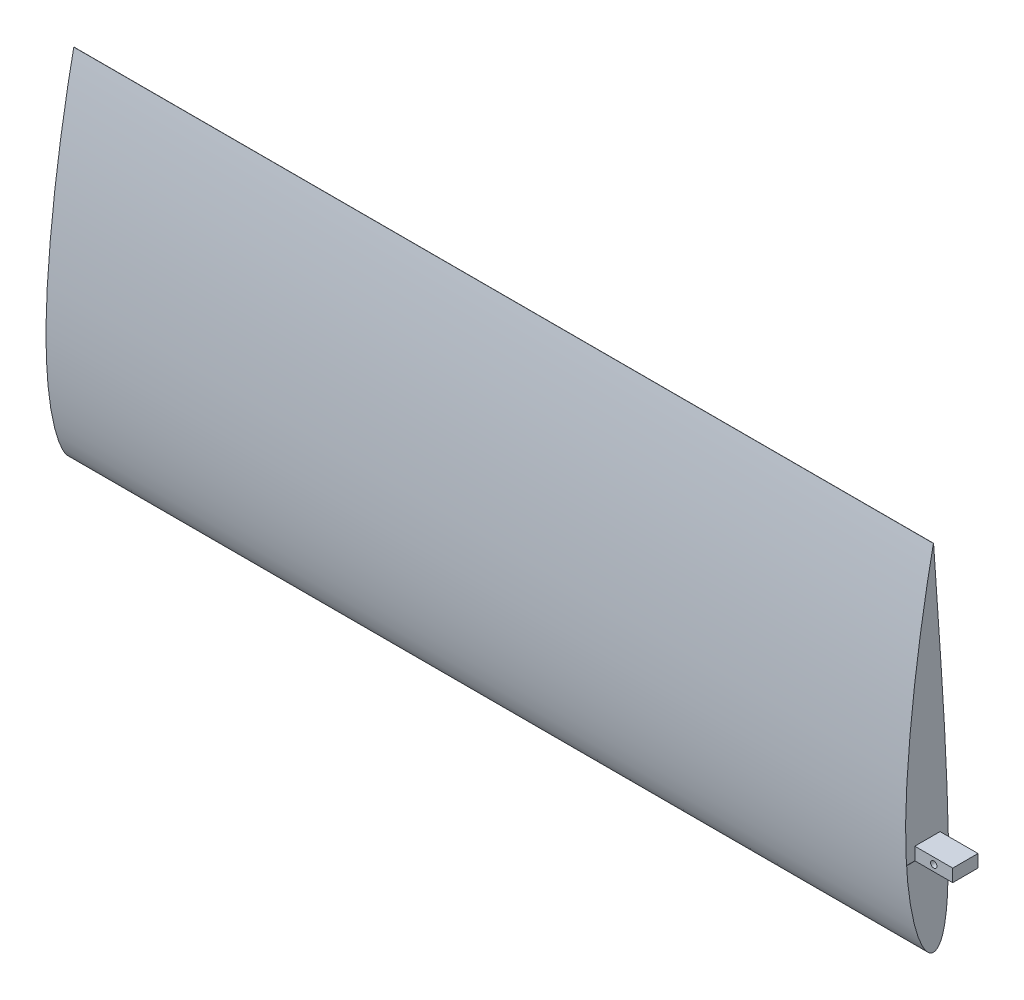
ISO-10303-21;
HEADER;
FILE_DESCRIPTION(('STEP AP214'),'2;1');
FILE_NAME('part.step','',(''),(''),'','','');
FILE_SCHEMA(('AUTOMOTIVE_DESIGN { 1 0 10303 214 1 1 1 1 }'));
ENDSEC;
DATA;
#1=APPLICATION_CONTEXT('core data for automotive mechanical design processes');
#2=APPLICATION_PROTOCOL_DEFINITION('international standard','automotive_design',2000,#1);
#3=PRODUCT_CONTEXT('',#1,'mechanical');
#4=PRODUCT('Part','Part','',(#3));
#5=PRODUCT_RELATED_PRODUCT_CATEGORY('part','',(#4));
#6=PRODUCT_DEFINITION_FORMATION('','',#4);
#7=PRODUCT_DEFINITION_CONTEXT('part definition',#1,'design');
#8=PRODUCT_DEFINITION('design','',#6,#7);
#9=PRODUCT_DEFINITION_SHAPE('','',#8);
#10=(LENGTH_UNIT() NAMED_UNIT(*) SI_UNIT(.MILLI.,.METRE.));
#11=(NAMED_UNIT(*) PLANE_ANGLE_UNIT() SI_UNIT($,.RADIAN.));
#12=(NAMED_UNIT(*) SI_UNIT($,.STERADIAN.) SOLID_ANGLE_UNIT());
#13=UNCERTAINTY_MEASURE_WITH_UNIT(LENGTH_MEASURE(1.E-05),#10,'distance_accuracy_value','');
#14=(GEOMETRIC_REPRESENTATION_CONTEXT(3) GLOBAL_UNCERTAINTY_ASSIGNED_CONTEXT((#13)) GLOBAL_UNIT_ASSIGNED_CONTEXT((#10,
#11,#12)) REPRESENTATION_CONTEXT('',''));
#15=CARTESIAN_POINT('',(0.,0.,0.));
#16=DIRECTION('',(0.,0.,1.));
#17=DIRECTION('',(1.,0.,0.));
#18=AXIS2_PLACEMENT_3D('',#15,#16,#17);
#19=CARTESIAN_POINT('',(-50.8,0.,-15.0555562963383));
#20=DIRECTION('',(-1.,0.,0.));
#21=DIRECTION('',(0.,0.,1.));
#22=AXIS2_PLACEMENT_3D('',#19,#20,#21);
#23=PLANE('',#22);
#24=DIRECTION('',(0.,1.,0.));
#25=VECTOR('',#24,1.);
#26=CARTESIAN_POINT('',(-50.8,88.6202636542648,26.5912377417045));
#27=LINE('',#26,#25);
#28=CARTESIAN_POINT('',(-50.8,88.6202636542648,26.5912377417045));
#29=VERTEX_POINT('',#28);
#30=CARTESIAN_POINT('',(-50.8,88.9250636542648,26.5912377417045));
#31=VERTEX_POINT('',#30);
#32=EDGE_CURVE('E151',#29,#31,#27,.T.);
#33=ORIENTED_EDGE('',*,*,#32,.T.);
#34=DIRECTION('',(0.,0.,1.));
#35=VECTOR('',#34,1.);
#36=CARTESIAN_POINT('',(-50.8,88.9250636542648,-14.4104133053878));
#37=LINE('',#36,#35);
#38=CARTESIAN_POINT('',(-50.8,88.9250636542648,-14.4104133053878));
#39=VERTEX_POINT('',#38);
#40=EDGE_CURVE('E57',#39,#31,#37,.T.);
#41=ORIENTED_EDGE('',*,*,#40,.F.);
#42=DIRECTION('',(0.,1.,0.));
#43=VECTOR('',#42,1.);
#44=CARTESIAN_POINT('',(-50.8,88.6202636542648,-14.4104133053878));
#45=LINE('',#44,#43);
#46=CARTESIAN_POINT('',(-50.8,88.6202636542648,-14.4104133053878));
#47=VERTEX_POINT('',#46);
#48=EDGE_CURVE('E142',#47,#39,#45,.T.);
#49=ORIENTED_EDGE('',*,*,#48,.F.);
#50=DIRECTION('',(0.,0.,1.));
#51=VECTOR('',#50,1.);
#52=CARTESIAN_POINT('',(-50.8,88.6202636542648,-14.4104133053878));
#53=LINE('',#52,#51);
#54=EDGE_CURVE('E145',#47,#29,#53,.T.);
#55=ORIENTED_EDGE('',*,*,#54,.T.);
#56=EDGE_LOOP('',(#33,#41,#49,#55));
#57=FACE_BOUND('',#56,.T.);
#58=CARTESIAN_POINT('',(-50.8000000000002,355.7016,0.0706893842356886));
#59=CARTESIAN_POINT('',(-50.8000000000002,353.82100547413,0.466477301049823));
#60=CARTESIAN_POINT('',(-50.8000000000002,350.062966049057,1.25739026761112));
#61=CARTESIAN_POINT('',(-50.8000000000002,344.419849120749,2.39126184336525));
#62=CARTESIAN_POINT('',(-50.8000000000002,338.780602166773,3.49581530783854));
#63=CARTESIAN_POINT('',(-50.8000000000002,333.145611842717,4.57193189726754));
#64=CARTESIAN_POINT('',(-50.8000000000002,327.516510889431,5.62414634625409));
#65=CARTESIAN_POINT('',(-50.8000000000002,321.894595016184,6.65413274344394));
#66=CARTESIAN_POINT('',(-50.8000000000002,314.419324108831,7.99739843751297));
#67=CARTESIAN_POINT('',(-50.8000000000002,303.257462970096,9.94552240604957));
#68=CARTESIAN_POINT('',(-50.8000000000002,290.277775074201,12.0956881119525));
#69=CARTESIAN_POINT('',(-50.8000000000002,277.369667999707,14.1082663790483));
#70=CARTESIAN_POINT('',(-50.8000000000002,266.404083363404,15.7296524484643));
#71=CARTESIAN_POINT('',(-50.8000000000002,251.980108497986,17.7452063131698));
#72=CARTESIAN_POINT('',(-50.8000000000002,237.689627435599,19.571200264272));
#73=CARTESIAN_POINT('',(-50.8000000000002,223.549431815772,21.2153057413522));
#74=CARTESIAN_POINT('',(-50.8000000000002,213.141900318429,22.3473669046667));
#75=CARTESIAN_POINT('',(-50.8000000000002,202.878012781937,23.3864814796233));
#76=CARTESIAN_POINT('',(-50.8000000000002,192.768060410721,24.3316742949856));
#77=CARTESIAN_POINT('',(-50.8000000000002,182.822187648844,25.1803267838034));
#78=CARTESIAN_POINT('',(-50.8000000000002,173.0503670548,25.9284845769859));
#79=CARTESIAN_POINT('',(-50.8000000000002,161.923020832939,26.6745625928463));
#80=CARTESIAN_POINT('',(-50.8000000000002,149.53571493793,27.3454863283283));
#81=CARTESIAN_POINT('',(-50.8000000000002,135.990974585577,27.8405517211889));
#82=CARTESIAN_POINT('',(-50.8000000000002,122.943312687998,28.0607256105301));
#83=CARTESIAN_POINT('',(-50.8000000000002,110.422427170652,28.0020460952983));
#84=CARTESIAN_POINT('',(-50.8000000000002,99.7020013483802,27.7028205773181));
#85=CARTESIAN_POINT('',(-50.8000000000002,90.6951719091241,27.2644303864963));
#86=CARTESIAN_POINT('',(-50.8000000000002,83.3050589433649,26.7782071290161));
#87=CARTESIAN_POINT('',(-50.8000000000002,76.1891846222825,26.1836028946291));
#88=CARTESIAN_POINT('',(-50.8000000000002,69.354718788338,25.486294475851));
#89=CARTESIAN_POINT('',(-50.8000000000002,62.8085372897284,24.6923981307771));
#90=CARTESIAN_POINT('',(-50.8000000000002,56.5572010238348,23.8083285855273));
#91=CARTESIAN_POINT('',(-50.8000000000002,50.6069732051584,22.8406877694768));
#92=CARTESIAN_POINT('',(-50.8000000000002,44.9638303686651,21.7962461660963));
#93=CARTESIAN_POINT('',(-50.8000000000002,39.6334152940903,20.681960011255));
#94=CARTESIAN_POINT('',(-50.8000000000002,35.3956425934143,19.6868775193447));
#95=CARTESIAN_POINT('',(-50.8000000000002,31.4207033717425,18.6688408456968));
#96=CARTESIAN_POINT('',(-50.8000000000002,28.4029957368285,17.8305039109673));
#97=CARTESIAN_POINT('',(-50.8000000000002,25.5022537885571,16.9530380094471));
#98=CARTESIAN_POINT('',(-50.8000000000002,23.4461522077182,16.2956888342787));
#99=CARTESIAN_POINT('',(-50.8000000000002,21.473655538579,15.6290160326846));
#100=CARTESIAN_POINT('',(-50.8000000000002,19.5852566859921,14.9539098171277));
#101=CARTESIAN_POINT('',(-50.8000000000002,17.7814209437135,14.2712536241703));
#102=CARTESIAN_POINT('',(-50.8000000000002,16.0625954458963,13.581895135171));
#103=CARTESIAN_POINT('',(-50.8000000000002,14.4291993290467,12.8866618837843));
#104=CARTESIAN_POINT('',(-50.8000000000002,12.8816283813181,12.186346806876));
#105=CARTESIAN_POINT('',(-50.8000000000002,11.4202611647561,11.4816860512912));
#106=CARTESIAN_POINT('',(-50.8000000000002,10.0454367904406,10.7733962918452));
#107=CARTESIAN_POINT('',(-50.8000000000002,8.75749036867076,10.0620978844044));
#108=CARTESIAN_POINT('',(-50.8000000000002,7.5567095077894,9.34839283952855));
#109=CARTESIAN_POINT('',(-50.8000000000002,6.44336997385442,8.63279200242914));
#110=CARTESIAN_POINT('',(-50.8000000000002,5.41771614805046,7.91573903030395));
#111=CARTESIAN_POINT('',(-50.8000000000002,4.47996706921155,7.19760595875919));
#112=CARTESIAN_POINT('',(-50.8000000000002,3.63032083391172,6.4786776696253));
#113=CARTESIAN_POINT('',(-50.8000000000002,2.86895727246491,5.75915597914262));
#114=CARTESIAN_POINT('',(-50.8000000000002,2.1960564902249,5.03914204783644));
#115=CARTESIAN_POINT('',(-50.8000000000002,1.61179873197572,4.31865755392047));
#116=CARTESIAN_POINT('',(-50.8000000000002,1.11641082020464,3.59763490600262));
#117=CARTESIAN_POINT('',(-50.8000000000002,0.710164515615321,2.8759525733831));
#118=CARTESIAN_POINT('',(-50.8000000000002,0.393485726810263,2.15348962597575));
#119=CARTESIAN_POINT('',(-50.8000000000002,0.166619571822764,1.43020250276967));
#120=CARTESIAN_POINT('',(-50.8000000000002,0.0307797900931819,0.706187065011474));
#121=CARTESIAN_POINT('',(-50.8000000000002,-0.0151142508197194,0.000985808458726927));
#122=CARTESIAN_POINT('',(-50.8000000000002,0.0300796252708967,-0.684756583833389));
#123=CARTESIAN_POINT('',(-50.8000000000002,0.16674071248494,-1.34869725562263));
#124=CARTESIAN_POINT('',(-50.8000000000002,0.393317066939228,-2.00765956253762));
#125=CARTESIAN_POINT('',(-50.8000000000002,0.710058446172872,-2.65944158261359));
#126=CARTESIAN_POINT('',(-50.8000000000002,1.11634326350183,-3.30210309499354));
#127=CARTESIAN_POINT('',(-50.8000000000002,1.6118571065413,-3.93390981207585));
#128=CARTESIAN_POINT('',(-50.8000000000002,2.19629777075188,-4.55329042504919));
#129=CARTESIAN_POINT('',(-50.8000000000002,2.86942812942426,-5.15882772659886));
#130=CARTESIAN_POINT('',(-50.8000000000002,3.63104857413439,-5.7492311534474));
#131=CARTESIAN_POINT('',(-50.8000000000002,4.48096984721655,-6.32335243426804));
#132=CARTESIAN_POINT('',(-50.8000000000002,5.41899948444723,-6.88018498243097));
#133=CARTESIAN_POINT('',(-50.8000000000002,6.44492900852289,-7.41888775545325));
#134=CARTESIAN_POINT('',(-50.8000000000002,7.55852826245218,-7.93878089676742));
#135=CARTESIAN_POINT('',(-50.8000000000002,8.75955182877978,-8.43933320131768));
#136=CARTESIAN_POINT('',(-50.8000000000002,10.0477190857056,-8.92018789878571));
#137=CARTESIAN_POINT('',(-50.8000000000002,11.4227355496629,-9.38111076006747));
#138=CARTESIAN_POINT('',(-50.8000000000002,12.8842702507698,-9.82204070896038));
#139=CARTESIAN_POINT('',(-50.8000000000002,14.4319785317173,-10.2430039785048));
#140=CARTESIAN_POINT('',(-50.8000000000002,16.065484925406,-10.644156377792));
#141=CARTESIAN_POINT('',(-50.8000000000002,17.7843936298771,-11.0257293145154));
#142=CARTESIAN_POINT('',(-50.8000000000002,19.588284464097,-11.3880307689595));
#143=CARTESIAN_POINT('',(-50.8000000000002,21.4767156197009,-11.7314054514538));
#144=CARTESIAN_POINT('',(-50.8000000000002,23.449222111398,-12.0562288485215));
#145=CARTESIAN_POINT('',(-50.8000000000002,25.5053140062167,-12.3629046422588));
#146=CARTESIAN_POINT('',(-50.8000000000002,27.6444822521562,-12.6518121496833));
#147=CARTESIAN_POINT('',(-50.8000000000002,29.8661952425766,-12.9233173431704));
#148=CARTESIAN_POINT('',(-50.8000000000002,32.169900275923,-13.1777575409131));
#149=CARTESIAN_POINT('',(-50.8000000000002,35.4023429888299,-13.4998524631016));
#150=CARTESIAN_POINT('',(-50.8000000000002,39.6441812113565,-13.8583123464398));
#151=CARTESIAN_POINT('',(-50.8000000000002,44.9738513274598,-14.2174741081025));
#152=CARTESIAN_POINT('',(-50.8000000000002,50.6162004375602,-14.5127942523532));
#153=CARTESIAN_POINT('',(-50.8000000000002,56.5656121165372,-14.7442901340839));
#154=CARTESIAN_POINT('',(-50.8000000000002,62.8161231261611,-14.9118009103629));
#155=CARTESIAN_POINT('',(-50.8000000000002,69.361468335569,-15.0153488068984));
#156=CARTESIAN_POINT('',(-50.8000000000002,76.1950734403075,-15.0555562963383));
#157=CARTESIAN_POINT('',(-50.8000000000002,83.310049607889,-15.0339273648));
#158=CARTESIAN_POINT('',(-50.8000000000002,90.699222817744,-14.953053609702));
#159=CARTESIAN_POINT('',(-50.8000000000002,98.3551507454826,-14.8165662842146));
#160=CARTESIAN_POINT('',(-50.8000000000002,106.270148539571,-14.6289263785114));
#161=CARTESIAN_POINT('',(-50.8000000000002,114.436264929365,-14.3950471321338));
#162=CARTESIAN_POINT('',(-50.8000000000002,122.845292004109,-14.1197978843387));
#163=CARTESIAN_POINT('',(-50.8000000000002,131.488784122986,-13.8074206502294));
#164=CARTESIAN_POINT('',(-50.8000000000002,140.358056448755,-13.4610919972191));
#165=CARTESIAN_POINT('',(-50.8000000000002,149.444192087624,-13.0825134469299));
#166=CARTESIAN_POINT('',(-50.8000000000002,161.966906534243,-12.5291182580423));
#167=CARTESIAN_POINT('',(-50.8000000000002,174.747012914087,-11.9142028134004));
#168=CARTESIAN_POINT('',(-50.8000000000002,187.771233814435,-11.230575460028));
#169=CARTESIAN_POINT('',(-50.8000000000002,197.800288277337,-10.673385511212));
#170=CARTESIAN_POINT('',(-50.8000000000002,207.988276057087,-10.0764432231545));
#171=CARTESIAN_POINT('',(-50.8000000000002,220.08793340203,-9.3336664589276));
#172=CARTESIAN_POINT('',(-50.8000000000002,232.345213803568,-8.5453888286307));
#173=CARTESIAN_POINT('',(-50.8000000000002,244.748251080315,-7.72788428925309));
#174=CARTESIAN_POINT('',(-50.8000000000002,255.522479057101,-7.01241007524803));
#175=CARTESIAN_POINT('',(-50.8000000000002,264.566087926404,-6.41324868666784));
#176=CARTESIAN_POINT('',(-50.8000000000002,273.68698108909,-5.81220554829879));
#177=CARTESIAN_POINT('',(-50.8000000000002,282.87600464249,-5.20989782426178));
#178=CARTESIAN_POINT('',(-50.8000000000002,293.955761905695,-4.48408262627243));
#179=CARTESIAN_POINT('',(-50.8000000000002,303.229482658674,-3.86773456692014));
#180=CARTESIAN_POINT('',(-50.8000000000002,310.676514811765,-3.36016125808153));
#181=CARTESIAN_POINT('',(-50.8000000000002,316.279904259101,-2.97024509509555));
#182=CARTESIAN_POINT('',(-50.8000000000002,321.893186998156,-2.57044306252481));
#183=CARTESIAN_POINT('',(-50.8000000000002,327.514926735223,-2.16053921271134));
#184=CARTESIAN_POINT('',(-50.8000000000002,333.143677999717,-1.74192554094544));
#185=CARTESIAN_POINT('',(-50.8000000000002,338.777987211423,-1.31771276115475));
#186=CARTESIAN_POINT('',(-50.8000000000002,344.416460161659,-0.895533141768276));
#187=CARTESIAN_POINT('',(-50.8000000000002,350.057405861939,-0.481329069908528));
#188=CARTESIAN_POINT('',(-50.8000000000002,353.820258158462,-0.231880232573303));
#189=CARTESIAN_POINT('',(-50.8000000000002,355.7016,-0.10716140280807));
#190=B_SPLINE_CURVE_WITH_KNOTS('',3,(#58,#59,#60,#61,#62,#63,#64,#65,#66,#67,#68,#69,#70,#71,
#72,#73,#74,#75,#76,#77,#78,#79,#80,#81,#82,#83,#84,#85,#86,#87,#88,#89,#90,#91,#92,#93,#94,#95,
#96,#97,#98,#99,#100,#101,#102,#103,#104,#105,#106,#107,#108,#109,#110,#111,#112,#113,#114,#115,
#116,#117,#118,#119,#120,#121,#122,#123,#124,#125,#126,#127,#128,#129,#130,#131,#132,#133,#134,
#135,#136,#137,#138,#139,#140,#141,#142,#143,#144,#145,#146,#147,#148,#149,#150,#151,#152,#153,
#154,#155,#156,#157,#158,#159,#160,#161,#162,#163,#164,#165,#166,#167,#168,#169,#170,#171,#172,
#173,#174,#175,#176,#177,#178,#179,#180,#181,#182,#183,#184,#185,#186,#187,#188,#189),
.UNSPECIFIED.,.F.,.F.,(4,1,1,1,1,1,1,1,1,1,1,1,1,1,1,1,1,1,1,1,1,1,1,1,1,1,1,1,1,1,1,1,1,1,1,1,
1,1,1,1,1,1,1,1,1,1,1,1,1,1,1,1,1,1,1,1,1,1,1,1,1,1,1,1,1,1,1,1,1,1,1,1,1,1,1,1,1,1,1,1,1,1,1,1,
1,1,1,1,1,1,1,1,1,1,1,1,1,1,1,1,1,1,1,1,1,1,1,1,1,1,1,1,1,1,1,1,1,1,1,1,1,1,1,1,1,1,1,1,1,4),
(0.,0.00794054253800827,0.0158677862260044,0.0237823355295012,0.0316838418205309,
0.0395714657177212,0.0474438053438306,0.0552994066495223,0.0709529074253012,0.0942599656642179,
0.109659748759335,0.124931367508802,0.140060474948947,0.16983616684281,0.184455938035171,
0.198878987847676,0.213091980808253,0.227081363790371,0.24083373334847,0.254335896346066,
0.267574897796778,0.286913018185408,0.305591757157393,0.323574750969682,0.340828861994365,
0.357323531066317,0.367884026456488,0.378086461731641,0.387923234082839,0.397387015236196,
0.406470797189749,0.415167950389097,0.423472243631592,0.431377770088885,0.438879021724844,
0.445971138884747,0.449362330648294,0.455832514431191,0.458910652184174,0.461883669269834,
0.464751272019807,0.467513247226822,0.470169459050699,0.472719871771161,0.475164566874604,
0.477503761569343,0.479737826283505,0.48186733255789,0.483893083712124,0.485816151684372,
0.487637951221375,0.489360302772708,0.490985530021076,0.492516542176065,0.49395700356015,
0.495311466006948,0.496585560552849,0.497786200428971,0.49892178695692,0.500002352220144,
0.501039639811119,0.502046986670077,0.503038994908549,0.503951730837978,0.504878158030601,
0.505831392661311,0.506823575724639,0.507865603008109,0.508967031971782,0.510136106550442,
0.511379884791428,0.512704371017619,0.514114660263003,0.51561509311769,0.517209348446535,
0.518900571097045,0.520691418544469,0.52258414386721,0.524580637882838,0.526682477749363,
0.528890963833217,0.531207133212725,0.533631806027993,0.536165598839476,0.538808937253662,
0.541562081086993,0.544425146730385,0.54739810801092,0.550480817074069,0.553673026528163,
0.556974385201834,0.563902733135108,0.571261380888569,0.579045037483656,0.587247420068503,
0.595861594725327,0.604880098032451,0.614294871054451,0.624097260748233,0.634278055645911,
0.644827521987638,0.655735355300336,0.666990798757914,0.678582536023013,0.690498842724987,
0.702727788654271,0.715257041549763,0.728074047062697,0.75452037740322,0.768123570697866,
0.781962351074077,0.79602290449003,0.810291084820141,0.832050541345135,0.84677287440772,
0.861649926398845,0.876666218949297,0.884221742698137,0.899417940676313,0.914715475207486,
0.930099899620206,0.937820202466263,0.94555696886631,0.953308312238934,0.961072258877045,
0.96884687873477,0.976629764477321,0.984418333857866,0.992209516036237,1.),.UNSPECIFIED.);
#191=CARTESIAN_POINT('',(-50.8,355.7016,0.0706893842356646));
#192=VERTEX_POINT('',#191);
#193=CARTESIAN_POINT('',(-50.8,0.,-0.00146867635679102));
#194=VERTEX_POINT('',#193);
#195=EDGE_CURVE('E207',#192,#194,#190,.T.);
#196=ORIENTED_EDGE('',*,*,#195,.T.);
#197=DIRECTION('',(0.,0.,1.));
#198=VECTOR('',#197,1.);
#199=CARTESIAN_POINT('',(-50.8,0.,-15.0555562963383));
#200=LINE('',#199,#198);
#201=CARTESIAN_POINT('',(-50.8,0.,-0.00159651902137056));
#202=VERTEX_POINT('',#201);
#203=EDGE_CURVE('E200',#202,#194,#200,.T.);
#204=ORIENTED_EDGE('',*,*,#203,.F.);
#205=CARTESIAN_POINT('',(-50.8000000000002,355.7016,-0.107161402808091));
#206=VERTEX_POINT('',#205);
#207=EDGE_CURVE('E203',#202,#206,#190,.T.);
#208=ORIENTED_EDGE('',*,*,#207,.T.);
#209=DIRECTION('',(0.,0.,1.));
#210=VECTOR('',#209,1.);
#211=CARTESIAN_POINT('',(-50.8,355.7016,-15.0555562963383));
#212=LINE('',#211,#210);
#213=EDGE_CURVE('E199',#206,#192,#212,.T.);
#214=ORIENTED_EDGE('',*,*,#213,.T.);
#215=EDGE_LOOP('',(#196,#204,#208,#214));
#216=FACE_BOUND('',#215,.T.);
#217=DIRECTION('',(0.,1.,0.));
#218=VECTOR('',#217,1.);
#219=CARTESIAN_POINT('',(-50.8,88.9253999999999,-6.61517218556163));
#220=LINE('',#219,#218);
#221=CARTESIAN_POINT('',(-50.8,88.9253999999999,-6.61517218556163));
#222=VERTEX_POINT('',#221);
#223=CARTESIAN_POINT('',(-50.8,101.6254,-6.61517218556162));
#224=VERTEX_POINT('',#223);
#225=EDGE_CURVE('E166',#222,#224,#220,.T.);
#226=ORIENTED_EDGE('',*,*,#225,.F.);
#227=DIRECTION('',(0.,0.,-1.));
#228=VECTOR('',#227,1.);
#229=CARTESIAN_POINT('',(-50.8,88.9253999999999,-6.61517218556163));
#230=LINE('',#229,#228);
#231=CARTESIAN_POINT('',(-50.8,88.9253999999999,18.7848278144384));
#232=VERTEX_POINT('',#231);
#233=EDGE_CURVE('E171',#232,#222,#230,.T.);
#234=ORIENTED_EDGE('',*,*,#233,.F.);
#235=DIRECTION('',(0.,-1.,0.));
#236=VECTOR('',#235,1.);
#237=CARTESIAN_POINT('',(-50.8,88.9253999999999,18.7848278144384));
#238=LINE('',#237,#236);
#239=CARTESIAN_POINT('',(-50.8,101.6254,18.7848278144384));
#240=VERTEX_POINT('',#239);
#241=EDGE_CURVE('E183',#240,#232,#238,.T.);
#242=ORIENTED_EDGE('',*,*,#241,.F.);
#243=DIRECTION('',(0.,0.,1.));
#244=VECTOR('',#243,1.);
#245=CARTESIAN_POINT('',(-50.8,101.6254,-6.61517218556162));
#246=LINE('',#245,#244);
#247=EDGE_CURVE('E180',#224,#240,#246,.T.);
#248=ORIENTED_EDGE('',*,*,#247,.F.);
#249=EDGE_LOOP('',(#226,#234,#242,#248));
#250=FACE_BOUND('',#249,.T.);
#251=ADVANCED_FACE('F41',(#57,#216,#250),#23,.F.);
#252=CARTESIAN_POINT('',(-914.4,355.7016,0.0706893842356886));
#253=CARTESIAN_POINT('',(-914.4,353.82100547413,0.466477301049823));
#254=CARTESIAN_POINT('',(-914.4,350.062966049057,1.25739026761112));
#255=CARTESIAN_POINT('',(-914.4,344.419849120749,2.39126184336525));
#256=CARTESIAN_POINT('',(-914.4,338.780602166773,3.49581530783854));
#257=CARTESIAN_POINT('',(-914.4,333.145611842717,4.57193189726754));
#258=CARTESIAN_POINT('',(-914.4,327.516510889431,5.62414634625409));
#259=CARTESIAN_POINT('',(-914.4,321.894595016184,6.65413274344394));
#260=CARTESIAN_POINT('',(-914.4,314.419324108831,7.99739843751297));
#261=CARTESIAN_POINT('',(-914.4,303.257462970096,9.94552240604957));
#262=CARTESIAN_POINT('',(-914.4,290.277775074201,12.0956881119525));
#263=CARTESIAN_POINT('',(-914.4,277.369667999707,14.1082663790483));
#264=CARTESIAN_POINT('',(-914.4,266.404083363404,15.7296524484643));
#265=CARTESIAN_POINT('',(-914.4,251.980108497986,17.7452063131698));
#266=CARTESIAN_POINT('',(-914.4,237.689627435599,19.571200264272));
#267=CARTESIAN_POINT('',(-914.4,223.549431815772,21.2153057413522));
#268=CARTESIAN_POINT('',(-914.4,213.141900318429,22.3473669046667));
#269=CARTESIAN_POINT('',(-914.4,202.878012781937,23.3864814796233));
#270=CARTESIAN_POINT('',(-914.4,192.768060410721,24.3316742949856));
#271=CARTESIAN_POINT('',(-914.4,182.822187648844,25.1803267838034));
#272=CARTESIAN_POINT('',(-914.4,173.0503670548,25.9284845769859));
#273=CARTESIAN_POINT('',(-914.4,161.923020832939,26.6745625928463));
#274=CARTESIAN_POINT('',(-914.4,149.53571493793,27.3454863283283));
#275=CARTESIAN_POINT('',(-914.4,135.990974585577,27.8405517211889));
#276=CARTESIAN_POINT('',(-914.4,122.943312687998,28.0607256105301));
#277=CARTESIAN_POINT('',(-914.4,110.422427170652,28.0020460952983));
#278=CARTESIAN_POINT('',(-914.4,99.7020013483802,27.7028205773181));
#279=CARTESIAN_POINT('',(-914.4,90.6951719091241,27.2644303864963));
#280=CARTESIAN_POINT('',(-914.4,83.3050589433649,26.7782071290161));
#281=CARTESIAN_POINT('',(-914.4,76.1891846222825,26.1836028946291));
#282=CARTESIAN_POINT('',(-914.4,69.354718788338,25.486294475851));
#283=CARTESIAN_POINT('',(-914.4,62.8085372897284,24.6923981307771));
#284=CARTESIAN_POINT('',(-914.4,56.5572010238348,23.8083285855273));
#285=CARTESIAN_POINT('',(-914.4,50.6069732051584,22.8406877694768));
#286=CARTESIAN_POINT('',(-914.4,44.9638303686651,21.7962461660963));
#287=CARTESIAN_POINT('',(-914.4,39.6334152940903,20.681960011255));
#288=CARTESIAN_POINT('',(-914.4,35.3956425934143,19.6868775193447));
#289=CARTESIAN_POINT('',(-914.4,31.4207033717425,18.6688408456968));
#290=CARTESIAN_POINT('',(-914.4,28.4029957368285,17.8305039109673));
#291=CARTESIAN_POINT('',(-914.4,25.5022537885571,16.9530380094471));
#292=CARTESIAN_POINT('',(-914.4,23.4461522077182,16.2956888342787));
#293=CARTESIAN_POINT('',(-914.4,21.473655538579,15.6290160326846));
#294=CARTESIAN_POINT('',(-914.4,19.5852566859921,14.9539098171277));
#295=CARTESIAN_POINT('',(-914.4,17.7814209437135,14.2712536241703));
#296=CARTESIAN_POINT('',(-914.4,16.0625954458963,13.581895135171));
#297=CARTESIAN_POINT('',(-914.4,14.4291993290467,12.8866618837843));
#298=CARTESIAN_POINT('',(-914.4,12.8816283813181,12.186346806876));
#299=CARTESIAN_POINT('',(-914.4,11.4202611647561,11.4816860512912));
#300=CARTESIAN_POINT('',(-914.4,10.0454367904406,10.7733962918452));
#301=CARTESIAN_POINT('',(-914.4,8.75749036867076,10.0620978844044));
#302=CARTESIAN_POINT('',(-914.4,7.5567095077894,9.34839283952855));
#303=CARTESIAN_POINT('',(-914.4,6.44336997385442,8.63279200242914));
#304=CARTESIAN_POINT('',(-914.4,5.41771614805046,7.91573903030395));
#305=CARTESIAN_POINT('',(-914.4,4.47996706921155,7.19760595875919));
#306=CARTESIAN_POINT('',(-914.4,3.63032083391172,6.4786776696253));
#307=CARTESIAN_POINT('',(-914.4,2.86895727246491,5.75915597914262));
#308=CARTESIAN_POINT('',(-914.4,2.1960564902249,5.03914204783644));
#309=CARTESIAN_POINT('',(-914.4,1.61179873197572,4.31865755392047));
#310=CARTESIAN_POINT('',(-914.4,1.11641082020464,3.59763490600262));
#311=CARTESIAN_POINT('',(-914.4,0.710164515615321,2.8759525733831));
#312=CARTESIAN_POINT('',(-914.4,0.393485726810263,2.15348962597575));
#313=CARTESIAN_POINT('',(-914.4,0.166619571822764,1.43020250276967));
#314=CARTESIAN_POINT('',(-914.4,0.0307797900931819,0.706187065011474));
#315=CARTESIAN_POINT('',(-914.4,-0.0151142508197194,0.000985808458726927));
#316=CARTESIAN_POINT('',(-914.4,0.0300796252708967,-0.684756583833389));
#317=CARTESIAN_POINT('',(-914.4,0.16674071248494,-1.34869725562263));
#318=CARTESIAN_POINT('',(-914.4,0.393317066939228,-2.00765956253762));
#319=CARTESIAN_POINT('',(-914.4,0.710058446172872,-2.65944158261359));
#320=CARTESIAN_POINT('',(-914.4,1.11634326350183,-3.30210309499354));
#321=CARTESIAN_POINT('',(-914.4,1.6118571065413,-3.93390981207585));
#322=CARTESIAN_POINT('',(-914.4,2.19629777075188,-4.55329042504919));
#323=CARTESIAN_POINT('',(-914.4,2.86942812942426,-5.15882772659886));
#324=CARTESIAN_POINT('',(-914.4,3.63104857413439,-5.7492311534474));
#325=CARTESIAN_POINT('',(-914.4,4.48096984721655,-6.32335243426804));
#326=CARTESIAN_POINT('',(-914.4,5.41899948444723,-6.88018498243097));
#327=CARTESIAN_POINT('',(-914.4,6.44492900852289,-7.41888775545325));
#328=CARTESIAN_POINT('',(-914.4,7.55852826245218,-7.93878089676742));
#329=CARTESIAN_POINT('',(-914.4,8.75955182877978,-8.43933320131768));
#330=CARTESIAN_POINT('',(-914.4,10.0477190857056,-8.92018789878571));
#331=CARTESIAN_POINT('',(-914.4,11.4227355496629,-9.38111076006747));
#332=CARTESIAN_POINT('',(-914.4,12.8842702507698,-9.82204070896038));
#333=CARTESIAN_POINT('',(-914.4,14.4319785317173,-10.2430039785048));
#334=CARTESIAN_POINT('',(-914.4,16.065484925406,-10.644156377792));
#335=CARTESIAN_POINT('',(-914.4,17.7843936298771,-11.0257293145154));
#336=CARTESIAN_POINT('',(-914.4,19.588284464097,-11.3880307689595));
#337=CARTESIAN_POINT('',(-914.4,21.4767156197009,-11.7314054514538));
#338=CARTESIAN_POINT('',(-914.4,23.449222111398,-12.0562288485215));
#339=CARTESIAN_POINT('',(-914.4,25.5053140062167,-12.3629046422588));
#340=CARTESIAN_POINT('',(-914.4,27.6444822521562,-12.6518121496833));
#341=CARTESIAN_POINT('',(-914.4,29.8661952425766,-12.9233173431704));
#342=CARTESIAN_POINT('',(-914.4,32.169900275923,-13.1777575409131));
#343=CARTESIAN_POINT('',(-914.4,35.4023429888299,-13.4998524631016));
#344=CARTESIAN_POINT('',(-914.4,39.6441812113565,-13.8583123464398));
#345=CARTESIAN_POINT('',(-914.4,44.9738513274598,-14.2174741081025));
#346=CARTESIAN_POINT('',(-914.4,50.6162004375602,-14.5127942523532));
#347=CARTESIAN_POINT('',(-914.4,56.5656121165372,-14.7442901340839));
#348=CARTESIAN_POINT('',(-914.4,62.8161231261611,-14.9118009103629));
#349=CARTESIAN_POINT('',(-914.4,69.361468335569,-15.0153488068984));
#350=CARTESIAN_POINT('',(-914.4,76.1950734403075,-15.0555562963383));
#351=CARTESIAN_POINT('',(-914.4,83.310049607889,-15.0339273648));
#352=CARTESIAN_POINT('',(-914.4,90.699222817744,-14.953053609702));
#353=CARTESIAN_POINT('',(-914.4,98.3551507454826,-14.8165662842146));
#354=CARTESIAN_POINT('',(-914.4,106.270148539571,-14.6289263785114));
#355=CARTESIAN_POINT('',(-914.4,114.436264929365,-14.3950471321338));
#356=CARTESIAN_POINT('',(-914.4,122.845292004109,-14.1197978843387));
#357=CARTESIAN_POINT('',(-914.4,131.488784122986,-13.8074206502294));
#358=CARTESIAN_POINT('',(-914.4,140.358056448755,-13.4610919972191));
#359=CARTESIAN_POINT('',(-914.4,149.444192087624,-13.0825134469299));
#360=CARTESIAN_POINT('',(-914.4,161.966906534243,-12.5291182580423));
#361=CARTESIAN_POINT('',(-914.4,174.747012914087,-11.9142028134004));
#362=CARTESIAN_POINT('',(-914.4,187.771233814435,-11.230575460028));
#363=CARTESIAN_POINT('',(-914.4,197.800288277337,-10.673385511212));
#364=CARTESIAN_POINT('',(-914.4,207.988276057087,-10.0764432231545));
#365=CARTESIAN_POINT('',(-914.4,220.08793340203,-9.3336664589276));
#366=CARTESIAN_POINT('',(-914.4,232.345213803568,-8.5453888286307));
#367=CARTESIAN_POINT('',(-914.4,244.748251080315,-7.72788428925309));
#368=CARTESIAN_POINT('',(-914.4,255.522479057101,-7.01241007524803));
#369=CARTESIAN_POINT('',(-914.4,264.566087926404,-6.41324868666784));
#370=CARTESIAN_POINT('',(-914.4,273.68698108909,-5.81220554829879));
#371=CARTESIAN_POINT('',(-914.4,282.87600464249,-5.20989782426178));
#372=CARTESIAN_POINT('',(-914.4,293.955761905695,-4.48408262627243));
#373=CARTESIAN_POINT('',(-914.4,303.229482658674,-3.86773456692014));
#374=CARTESIAN_POINT('',(-914.4,310.676514811765,-3.36016125808153));
#375=CARTESIAN_POINT('',(-914.4,316.279904259101,-2.97024509509555));
#376=CARTESIAN_POINT('',(-914.4,321.893186998156,-2.57044306252481));
#377=CARTESIAN_POINT('',(-914.4,327.514926735223,-2.16053921271134));
#378=CARTESIAN_POINT('',(-914.4,333.143677999717,-1.74192554094544));
#379=CARTESIAN_POINT('',(-914.4,338.777987211423,-1.31771276115475));
#380=CARTESIAN_POINT('',(-914.4,344.416460161659,-0.895533141768276));
#381=CARTESIAN_POINT('',(-914.4,350.057405861939,-0.481329069908528));
#382=CARTESIAN_POINT('',(-914.4,353.820258158462,-0.231880232573303));
#383=CARTESIAN_POINT('',(-914.4,355.7016,-0.10716140280807));
#384=B_SPLINE_CURVE_WITH_KNOTS('',3,(#252,#253,#254,#255,#256,#257,#258,#259,#260,#261,#262,
#263,#264,#265,#266,#267,#268,#269,#270,#271,#272,#273,#274,#275,#276,#277,#278,#279,#280,#281,
#282,#283,#284,#285,#286,#287,#288,#289,#290,#291,#292,#293,#294,#295,#296,#297,#298,#299,#300,
#301,#302,#303,#304,#305,#306,#307,#308,#309,#310,#311,#312,#313,#314,#315,#316,#317,#318,#319,
#320,#321,#322,#323,#324,#325,#326,#327,#328,#329,#330,#331,#332,#333,#334,#335,#336,#337,#338,
#339,#340,#341,#342,#343,#344,#345,#346,#347,#348,#349,#350,#351,#352,#353,#354,#355,#356,#357,
#358,#359,#360,#361,#362,#363,#364,#365,#366,#367,#368,#369,#370,#371,#372,#373,#374,#375,#376,
#377,#378,#379,#380,#381,#382,#383),.UNSPECIFIED.,.F.,.F.,(4,1,1,1,1,1,1,1,1,1,1,1,1,1,1,1,1,1,
1,1,1,1,1,1,1,1,1,1,1,1,1,1,1,1,1,1,1,1,1,1,1,1,1,1,1,1,1,1,1,1,1,1,1,1,1,1,1,1,1,1,1,1,1,1,1,1,
1,1,1,1,1,1,1,1,1,1,1,1,1,1,1,1,1,1,1,1,1,1,1,1,1,1,1,1,1,1,1,1,1,1,1,1,1,1,1,1,1,1,1,1,1,1,1,1,
1,1,1,1,1,1,1,1,1,1,1,1,1,1,1,4),(0.,0.00794054253800827,0.0158677862260044,0.0237823355295012,
0.0316838418205309,0.0395714657177212,0.0474438053438306,0.0552994066495223,0.0709529074253012,
0.0942599656642179,0.109659748759335,0.124931367508802,0.140060474948947,0.16983616684281,
0.184455938035171,0.198878987847676,0.213091980808253,0.227081363790371,0.24083373334847,
0.254335896346066,0.267574897796778,0.286913018185408,0.305591757157393,0.323574750969682,
0.340828861994365,0.357323531066317,0.367884026456488,0.378086461731641,0.387923234082839,
0.397387015236196,0.406470797189749,0.415167950389097,0.423472243631592,0.431377770088885,
0.438879021724844,0.445971138884747,0.449362330648294,0.455832514431191,0.458910652184174,
0.461883669269834,0.464751272019807,0.467513247226822,0.470169459050699,0.472719871771161,
0.475164566874604,0.477503761569343,0.479737826283505,0.48186733255789,0.483893083712124,
0.485816151684372,0.487637951221375,0.489360302772708,0.490985530021076,0.492516542176065,
0.49395700356015,0.495311466006948,0.496585560552849,0.497786200428971,0.49892178695692,
0.500002352220144,0.501039639811119,0.502046986670077,0.503038994908549,0.503951730837978,
0.504878158030601,0.505831392661311,0.506823575724639,0.507865603008109,0.508967031971782,
0.510136106550442,0.511379884791428,0.512704371017619,0.514114660263003,0.51561509311769,
0.517209348446535,0.518900571097045,0.520691418544469,0.52258414386721,0.524580637882838,
0.526682477749363,0.528890963833217,0.531207133212725,0.533631806027993,0.536165598839476,
0.538808937253662,0.541562081086993,0.544425146730385,0.54739810801092,0.550480817074069,
0.553673026528163,0.556974385201834,0.563902733135108,0.571261380888569,0.579045037483656,
0.587247420068503,0.595861594725327,0.604880098032451,0.614294871054451,0.624097260748233,
0.634278055645911,0.644827521987638,0.655735355300336,0.666990798757914,0.678582536023013,
0.690498842724987,0.702727788654271,0.715257041549763,0.728074047062697,0.75452037740322,
0.768123570697866,0.781962351074077,0.79602290449003,0.810291084820141,0.832050541345135,
0.84677287440772,0.861649926398845,0.876666218949297,0.884221742698137,0.899417940676313,
0.914715475207486,0.930099899620206,0.937820202466263,0.94555696886631,0.953308312238934,
0.961072258877045,0.96884687873477,0.976629764477321,0.984418333857866,0.992209516036237,1.),.UNSPECIFIED.);
#385=DIRECTION('',(1.,0.,0.));
#386=VECTOR('',#385,1.);
#387=SURFACE_OF_LINEAR_EXTRUSION('',#384,#386);
#388=ORIENTED_EDGE('',*,*,#195,.F.);
#389=DIRECTION('',(1.,0.,0.));
#390=VECTOR('',#389,1.);
#391=CARTESIAN_POINT('',(-914.4,355.7016,0.070689384235668));
#392=LINE('',#391,#390);
#393=CARTESIAN_POINT('',(-914.4,355.7016,0.070689384235668));
#394=VERTEX_POINT('',#393);
#395=EDGE_CURVE('E11',#394,#192,#392,.T.);
#396=ORIENTED_EDGE('',*,*,#395,.F.);
#397=CARTESIAN_POINT('',(-914.4,355.7016,-0.107161402808091));
#398=VERTEX_POINT('',#397);
#399=EDGE_CURVE('E208',#394,#398,#384,.T.);
#400=ORIENTED_EDGE('',*,*,#399,.T.);
#401=DIRECTION('',(1.,0.,0.));
#402=VECTOR('',#401,1.);
#403=CARTESIAN_POINT('',(-914.4,355.7016,-0.107161402808091));
#404=LINE('',#403,#402);
#405=EDGE_CURVE('E46',#398,#206,#404,.T.);
#406=ORIENTED_EDGE('',*,*,#405,.T.);
#407=ORIENTED_EDGE('',*,*,#207,.F.);
#408=ORIENTED_EDGE('',*,*,#203,.T.);
#409=EDGE_LOOP('',(#388,#396,#400,#406,#407,#408));
#410=FACE_BOUND('',#409,.T.);
#411=ADVANCED_FACE('F43',(#410),#387,.T.);
#412=CARTESIAN_POINT('',(-914.4,355.7016,-0.107161402808091));
#413=DIRECTION('',(0.,1.,0.));
#414=DIRECTION('',(0.,0.,1.));
#415=AXIS2_PLACEMENT_3D('',#412,#413,#414);
#416=PLANE('',#415);
#417=ORIENTED_EDGE('',*,*,#213,.F.);
#418=ORIENTED_EDGE('',*,*,#405,.F.);
#419=DIRECTION('',(0.,0.,1.));
#420=VECTOR('',#419,1.);
#421=CARTESIAN_POINT('',(-914.4,355.7016,-0.107161402808091));
#422=LINE('',#421,#420);
#423=EDGE_CURVE('E217',#398,#394,#422,.T.);
#424=ORIENTED_EDGE('',*,*,#423,.T.);
#425=ORIENTED_EDGE('',*,*,#395,.T.);
#426=EDGE_LOOP('',(#417,#418,#424,#425));
#427=FACE_BOUND('',#426,.T.);
#428=ADVANCED_FACE('F230',(#427),#416,.T.);
#429=CARTESIAN_POINT('',(-914.4,0.40351318908503,2.14031093020161));
#430=DIRECTION('',(-1.,0.,0.));
#431=DIRECTION('',(0.,0.,1.));
#432=AXIS2_PLACEMENT_3D('',#429,#430,#431);
#433=PLANE('',#432);
#434=DIRECTION('',(0.,0.,1.));
#435=VECTOR('',#434,1.);
#436=CARTESIAN_POINT('',(-914.4,88.9250636542648,-14.4104133053878));
#437=LINE('',#436,#435);
#438=CARTESIAN_POINT('',(-914.4,88.9250636542648,-14.4104133053878));
#439=VERTEX_POINT('',#438);
#440=CARTESIAN_POINT('',(-914.4,88.9250636542648,26.5912377417045));
#441=VERTEX_POINT('',#440);
#442=EDGE_CURVE('E132',#439,#441,#437,.T.);
#443=ORIENTED_EDGE('',*,*,#442,.T.);
#444=DIRECTION('',(0.,1.,0.));
#445=VECTOR('',#444,1.);
#446=CARTESIAN_POINT('',(-914.4,88.6202636542648,26.5912377417045));
#447=LINE('',#446,#445);
#448=CARTESIAN_POINT('',(-914.4,88.6202636542648,26.5912377417045));
#449=VERTEX_POINT('',#448);
#450=EDGE_CURVE('E124',#449,#441,#447,.T.);
#451=ORIENTED_EDGE('',*,*,#450,.F.);
#452=DIRECTION('',(0.,0.,1.));
#453=VECTOR('',#452,1.);
#454=CARTESIAN_POINT('',(-914.4,88.6202636542648,-14.4104133053878));
#455=LINE('',#454,#453);
#456=CARTESIAN_POINT('',(-914.4,88.6202636542648,-14.4104133053878));
#457=VERTEX_POINT('',#456);
#458=EDGE_CURVE('E131',#457,#449,#455,.T.);
#459=ORIENTED_EDGE('',*,*,#458,.F.);
#460=DIRECTION('',(0.,1.,0.));
#461=VECTOR('',#460,1.);
#462=CARTESIAN_POINT('',(-914.4,88.6202636542648,-14.4104133053878));
#463=LINE('',#462,#461);
#464=EDGE_CURVE('E137',#457,#439,#463,.T.);
#465=ORIENTED_EDGE('',*,*,#464,.T.);
#466=EDGE_LOOP('',(#443,#451,#459,#465));
#467=FACE_BOUND('',#466,.T.);
#468=ORIENTED_EDGE('',*,*,#399,.F.);
#469=ORIENTED_EDGE('',*,*,#423,.F.);
#470=EDGE_LOOP('',(#468,#469));
#471=FACE_BOUND('',#470,.T.);
#472=ADVANCED_FACE('F139',(#467,#471),#433,.T.);
#473=CARTESIAN_POINT('',(-12.7,88.9253999999999,-6.61517218556163));
#474=DIRECTION('',(0.,0.,1.));
#475=DIRECTION('',(0.,-1.,0.));
#476=AXIS2_PLACEMENT_3D('',#473,#474,#475);
#477=PLANE('',#476);
#478=CARTESIAN_POINT('',(-31.75,95.2753999999999,-6.61517218556162));
#479=DIRECTION('',(0.,0.,1.));
#480=DIRECTION('',(0.,-1.,0.));
#481=AXIS2_PLACEMENT_3D('',#478,#479,#480);
#482=CIRCLE('',#481,3.175);
#483=CARTESIAN_POINT('',(-31.75,92.1003999999999,-6.61517218556163));
#484=VERTEX_POINT('',#483);
#485=EDGE_CURVE('E163',#484,#484,#482,.T.);
#486=ORIENTED_EDGE('',*,*,#485,.T.);
#487=EDGE_LOOP('',(#486));
#488=FACE_BOUND('',#487,.T.);
#489=ORIENTED_EDGE('',*,*,#225,.T.);
#490=DIRECTION('',(-1.,0.,0.));
#491=VECTOR('',#490,1.);
#492=CARTESIAN_POINT('',(-12.7,101.6254,-6.61517218556162));
#493=LINE('',#492,#491);
#494=CARTESIAN_POINT('',(-12.7,101.6254,-6.61517218556162));
#495=VERTEX_POINT('',#494);
#496=EDGE_CURVE('E196',#495,#224,#493,.T.);
#497=ORIENTED_EDGE('',*,*,#496,.F.);
#498=DIRECTION('',(0.,1.,0.));
#499=VECTOR('',#498,1.);
#500=CARTESIAN_POINT('',(-12.7,88.9253999999999,-6.61517218556163));
#501=LINE('',#500,#499);
#502=CARTESIAN_POINT('',(-12.7,88.9253999999999,-6.61517218556163));
#503=VERTEX_POINT('',#502);
#504=EDGE_CURVE('E167',#503,#495,#501,.T.);
#505=ORIENTED_EDGE('',*,*,#504,.F.);
#506=DIRECTION('',(-1.,0.,0.));
#507=VECTOR('',#506,1.);
#508=CARTESIAN_POINT('',(-12.7,88.9253999999999,-6.61517218556163));
#509=LINE('',#508,#507);
#510=EDGE_CURVE('E177',#503,#222,#509,.T.);
#511=ORIENTED_EDGE('',*,*,#510,.T.);
#512=EDGE_LOOP('',(#489,#497,#505,#511));
#513=FACE_BOUND('',#512,.T.);
#514=ADVANCED_FACE('F234',(#488,#513),#477,.F.);
#515=CARTESIAN_POINT('',(-12.7,101.6254,-6.61517218556162));
#516=DIRECTION('',(0.,-1.,0.));
#517=DIRECTION('',(0.,0.,-1.));
#518=AXIS2_PLACEMENT_3D('',#515,#516,#517);
#519=PLANE('',#518);
#520=ORIENTED_EDGE('',*,*,#247,.T.);
#521=DIRECTION('',(-1.,0.,0.));
#522=VECTOR('',#521,1.);
#523=CARTESIAN_POINT('',(-12.7,101.6254,18.7848278144384));
#524=LINE('',#523,#522);
#525=CARTESIAN_POINT('',(-12.7,101.6254,18.7848278144384));
#526=VERTEX_POINT('',#525);
#527=EDGE_CURVE('E193',#526,#240,#524,.T.);
#528=ORIENTED_EDGE('',*,*,#527,.F.);
#529=DIRECTION('',(0.,0.,1.));
#530=VECTOR('',#529,1.);
#531=CARTESIAN_POINT('',(-12.7,101.6254,-6.61517218556162));
#532=LINE('',#531,#530);
#533=EDGE_CURVE('E170',#495,#526,#532,.T.);
#534=ORIENTED_EDGE('',*,*,#533,.F.);
#535=ORIENTED_EDGE('',*,*,#496,.T.);
#536=EDGE_LOOP('',(#520,#528,#534,#535));
#537=FACE_BOUND('',#536,.T.);
#538=ADVANCED_FACE('F241',(#537),#519,.F.);
#539=CARTESIAN_POINT('',(-12.7,88.9253999999999,18.7848278144384));
#540=DIRECTION('',(0.,0.,-1.));
#541=DIRECTION('',(-1.,0.,0.));
#542=AXIS2_PLACEMENT_3D('',#539,#540,#541);
#543=PLANE('',#542);
#544=CARTESIAN_POINT('',(-31.75,95.2753999999999,18.7848278144384));
#545=DIRECTION('',(0.,0.,1.));
#546=DIRECTION('',(1.,0.,0.));
#547=AXIS2_PLACEMENT_3D('',#544,#545,#546);
#548=CIRCLE('',#547,3.175);
#549=CARTESIAN_POINT('',(-28.575,95.2753999999999,18.7848278144384));
#550=VERTEX_POINT('',#549);
#551=EDGE_CURVE('E157',#550,#550,#548,.T.);
#552=ORIENTED_EDGE('',*,*,#551,.F.);
#553=EDGE_LOOP('',(#552));
#554=FACE_BOUND('',#553,.T.);
#555=ORIENTED_EDGE('',*,*,#241,.T.);
#556=DIRECTION('',(-1.,0.,0.));
#557=VECTOR('',#556,1.);
#558=CARTESIAN_POINT('',(-12.7,88.9253999999999,18.7848278144384));
#559=LINE('',#558,#557);
#560=CARTESIAN_POINT('',(-12.7,88.9253999999999,18.7848278144384));
#561=VERTEX_POINT('',#560);
#562=EDGE_CURVE('E190',#561,#232,#559,.T.);
#563=ORIENTED_EDGE('',*,*,#562,.F.);
#564=DIRECTION('',(0.,-1.,0.));
#565=VECTOR('',#564,1.);
#566=CARTESIAN_POINT('',(-12.7,88.9253999999999,18.7848278144384));
#567=LINE('',#566,#565);
#568=EDGE_CURVE('E173',#526,#561,#567,.T.);
#569=ORIENTED_EDGE('',*,*,#568,.F.);
#570=ORIENTED_EDGE('',*,*,#527,.T.);
#571=EDGE_LOOP('',(#555,#563,#569,#570));
#572=FACE_BOUND('',#571,.T.);
#573=ADVANCED_FACE('F254',(#554,#572),#543,.F.);
#574=CARTESIAN_POINT('',(-12.7,88.9253999999999,-6.61517218556163));
#575=DIRECTION('',(0.,1.,0.));
#576=DIRECTION('',(0.,0.,1.));
#577=AXIS2_PLACEMENT_3D('',#574,#575,#576);
#578=PLANE('',#577);
#579=ORIENTED_EDGE('',*,*,#233,.T.);
#580=ORIENTED_EDGE('',*,*,#510,.F.);
#581=DIRECTION('',(0.,0.,-1.));
#582=VECTOR('',#581,1.);
#583=CARTESIAN_POINT('',(-12.7,88.9253999999999,-6.61517218556163));
#584=LINE('',#583,#582);
#585=EDGE_CURVE('E175',#561,#503,#584,.T.);
#586=ORIENTED_EDGE('',*,*,#585,.F.);
#587=ORIENTED_EDGE('',*,*,#562,.T.);
#588=EDGE_LOOP('',(#579,#580,#586,#587));
#589=FACE_BOUND('',#588,.T.);
#590=ADVANCED_FACE('F258',(#589),#578,.F.);
#591=CARTESIAN_POINT('',(-12.7,0.,0.));
#592=DIRECTION('',(1.,0.,0.));
#593=DIRECTION('',(0.,0.,-1.));
#594=AXIS2_PLACEMENT_3D('',#591,#592,#593);
#595=PLANE('',#594);
#596=ORIENTED_EDGE('',*,*,#504,.T.);
#597=ORIENTED_EDGE('',*,*,#533,.T.);
#598=ORIENTED_EDGE('',*,*,#568,.T.);
#599=ORIENTED_EDGE('',*,*,#585,.T.);
#600=EDGE_LOOP('',(#596,#597,#598,#599));
#601=FACE_BOUND('',#600,.T.);
#602=ADVANCED_FACE('F262',(#601),#595,.T.);
#603=CARTESIAN_POINT('',(-31.75,95.2753999999999,-15.0555562963383));
#604=DIRECTION('',(0.,0.,1.));
#605=DIRECTION('',(1.,0.,0.));
#606=AXIS2_PLACEMENT_3D('',#603,#604,#605);
#607=CYLINDRICAL_SURFACE('',#606,3.175);
#608=ORIENTED_EDGE('',*,*,#551,.T.);
#609=EDGE_LOOP('',(#608));
#610=FACE_BOUND('',#609,.T.);
#611=ORIENTED_EDGE('',*,*,#485,.F.);
#612=EDGE_LOOP('',(#611));
#613=FACE_BOUND('',#612,.T.);
#614=ADVANCED_FACE('F266',(#610,#613),#607,.F.);
#615=CARTESIAN_POINT('',(-914.4,88.9250636542648,-14.4104133053878));
#616=DIRECTION('',(0.,1.,0.));
#617=DIRECTION('',(0.,0.,1.));
#618=AXIS2_PLACEMENT_3D('',#615,#616,#617);
#619=PLANE('',#618);
#620=ORIENTED_EDGE('',*,*,#40,.T.);
#621=DIRECTION('',(1.,0.,0.));
#622=VECTOR('',#621,1.);
#623=CARTESIAN_POINT('',(-914.4,88.9250636542648,26.5912377417045));
#624=LINE('',#623,#622);
#625=EDGE_CURVE('E126',#441,#31,#624,.T.);
#626=ORIENTED_EDGE('',*,*,#625,.F.);
#627=ORIENTED_EDGE('',*,*,#442,.F.);
#628=DIRECTION('',(1.,0.,0.));
#629=VECTOR('',#628,1.);
#630=CARTESIAN_POINT('',(-914.4,88.9250636542648,-14.4104133053878));
#631=LINE('',#630,#629);
#632=EDGE_CURVE('E155',#439,#39,#631,.T.);
#633=ORIENTED_EDGE('',*,*,#632,.T.);
#634=EDGE_LOOP('',(#620,#626,#627,#633));
#635=FACE_BOUND('',#634,.T.);
#636=ADVANCED_FACE('F135',(#635),#619,.F.);
#637=CARTESIAN_POINT('',(-914.4,88.6202636542648,-14.4104133053878));
#638=DIRECTION('',(0.,0.,-1.));
#639=DIRECTION('',(-1.,0.,0.));
#640=AXIS2_PLACEMENT_3D('',#637,#638,#639);
#641=PLANE('',#640);
#642=ORIENTED_EDGE('',*,*,#48,.T.);
#643=ORIENTED_EDGE('',*,*,#632,.F.);
#644=ORIENTED_EDGE('',*,*,#464,.F.);
#645=DIRECTION('',(1.,0.,0.));
#646=VECTOR('',#645,1.);
#647=CARTESIAN_POINT('',(-914.4,88.6202636542648,-14.4104133053878));
#648=LINE('',#647,#646);
#649=EDGE_CURVE('E158',#457,#47,#648,.T.);
#650=ORIENTED_EDGE('',*,*,#649,.T.);
#651=EDGE_LOOP('',(#642,#643,#644,#650));
#652=FACE_BOUND('',#651,.T.);
#653=ADVANCED_FACE('F272',(#652),#641,.F.);
#654=CARTESIAN_POINT('',(-914.4,88.6202636542648,-14.4104133053878));
#655=DIRECTION('',(0.,1.,0.));
#656=DIRECTION('',(0.,0.,1.));
#657=AXIS2_PLACEMENT_3D('',#654,#655,#656);
#658=PLANE('',#657);
#659=ORIENTED_EDGE('',*,*,#54,.F.);
#660=ORIENTED_EDGE('',*,*,#649,.F.);
#661=ORIENTED_EDGE('',*,*,#458,.T.);
#662=DIRECTION('',(1.,0.,0.));
#663=VECTOR('',#662,1.);
#664=CARTESIAN_POINT('',(-914.4,88.6202636542648,26.5912377417045));
#665=LINE('',#664,#663);
#666=EDGE_CURVE('E65',#449,#29,#665,.T.);
#667=ORIENTED_EDGE('',*,*,#666,.T.);
#668=EDGE_LOOP('',(#659,#660,#661,#667));
#669=FACE_BOUND('',#668,.T.);
#670=ADVANCED_FACE('F275',(#669),#658,.T.);
#671=CARTESIAN_POINT('',(-914.4,88.6202636542648,26.5912377417045));
#672=DIRECTION('',(0.,0.,-1.));
#673=DIRECTION('',(-1.,0.,0.));
#674=AXIS2_PLACEMENT_3D('',#671,#672,#673);
#675=PLANE('',#674);
#676=ORIENTED_EDGE('',*,*,#32,.F.);
#677=ORIENTED_EDGE('',*,*,#666,.F.);
#678=ORIENTED_EDGE('',*,*,#450,.T.);
#679=ORIENTED_EDGE('',*,*,#625,.T.);
#680=EDGE_LOOP('',(#676,#677,#678,#679));
#681=FACE_BOUND('',#680,.T.);
#682=ADVANCED_FACE('F125',(#681),#675,.T.);
#683=CLOSED_SHELL('',(#251,#411,#428,#472,#514,#538,#573,#590,#602,#614,#636,#653,#670,#682));
#684=MANIFOLD_SOLID_BREP('B2',#683);
#685=ADVANCED_BREP_SHAPE_REPRESENTATION('',(#18,#684),#14);
#686=SHAPE_DEFINITION_REPRESENTATION(#9,#685);
ENDSEC;
END-ISO-10303-21;
